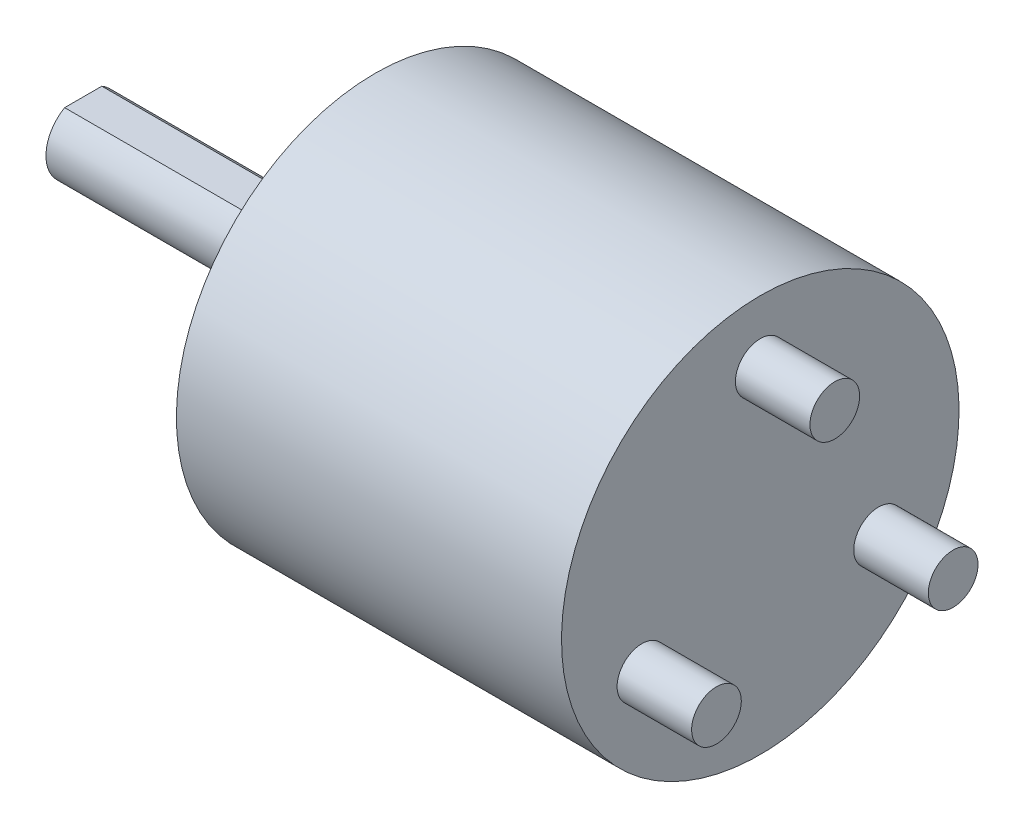
ISO-10303-21;
HEADER;
FILE_DESCRIPTION(('STEP AP214'),'2;1');
FILE_NAME('part.step','',(''),(''),'','','');
FILE_SCHEMA(('AUTOMOTIVE_DESIGN { 1 0 10303 214 1 1 1 1 }'));
ENDSEC;
DATA;
#1=APPLICATION_CONTEXT('core data for automotive mechanical design processes');
#2=APPLICATION_PROTOCOL_DEFINITION('international standard','automotive_design',2000,#1);
#3=PRODUCT_CONTEXT('',#1,'mechanical');
#4=PRODUCT('Part','Part','',(#3));
#5=PRODUCT_RELATED_PRODUCT_CATEGORY('part','',(#4));
#6=PRODUCT_DEFINITION_FORMATION('','',#4);
#7=PRODUCT_DEFINITION_CONTEXT('part definition',#1,'design');
#8=PRODUCT_DEFINITION('design','',#6,#7);
#9=PRODUCT_DEFINITION_SHAPE('','',#8);
#10=(LENGTH_UNIT() NAMED_UNIT(*) SI_UNIT(.MILLI.,.METRE.));
#11=(NAMED_UNIT(*) PLANE_ANGLE_UNIT() SI_UNIT($,.RADIAN.));
#12=(NAMED_UNIT(*) SI_UNIT($,.STERADIAN.) SOLID_ANGLE_UNIT());
#13=UNCERTAINTY_MEASURE_WITH_UNIT(LENGTH_MEASURE(1.E-05),#10,'distance_accuracy_value','');
#14=(GEOMETRIC_REPRESENTATION_CONTEXT(3) GLOBAL_UNCERTAINTY_ASSIGNED_CONTEXT((#13)) GLOBAL_UNIT_ASSIGNED_CONTEXT((#10,
#11,#12)) REPRESENTATION_CONTEXT('',''));
#15=CARTESIAN_POINT('',(0.,0.,0.));
#16=DIRECTION('',(0.,0.,1.));
#17=DIRECTION('',(1.,0.,0.));
#18=AXIS2_PLACEMENT_3D('',#15,#16,#17);
#19=CARTESIAN_POINT('',(16.625,-3.762,-5.775139721));
#20=DIRECTION('',(1.,0.,0.));
#21=DIRECTION('',(0.,1.,0.));
#22=AXIS2_PLACEMENT_3D('',#19,#20,#21);
#23=PLANE('',#22);
#24=CARTESIAN_POINT('',(16.625,-2.75,-4.763139721));
#25=DIRECTION('',(1.,0.,0.));
#26=DIRECTION('',(0.,0.,-1.));
#27=AXIS2_PLACEMENT_3D('',#24,#25,#26);
#28=CIRCLE('',#27,1.);
#29=CARTESIAN_POINT('',(16.625,-2.75,-5.763139721));
#30=VERTEX_POINT('',#29);
#31=EDGE_CURVE('E20',#30,#30,#28,.T.);
#32=ORIENTED_EDGE('',*,*,#31,.T.);
#33=EDGE_LOOP('',(#32));
#34=FACE_BOUND('',#33,.T.);
#35=ADVANCED_FACE('F16',(#34),#23,.T.);
#36=CARTESIAN_POINT('',(16.625,-3.762,5.775139721));
#37=DIRECTION('',(1.,0.,0.));
#38=DIRECTION('',(0.,0.,-1.));
#39=AXIS2_PLACEMENT_3D('',#36,#37,#38);
#40=PLANE('',#39);
#41=CARTESIAN_POINT('',(16.625,-2.75,4.763139721));
#42=DIRECTION('',(1.,0.,0.));
#43=DIRECTION('',(0.,1.,0.));
#44=AXIS2_PLACEMENT_3D('',#41,#42,#43);
#45=CIRCLE('',#44,0.999999999999999);
#46=CARTESIAN_POINT('',(16.625,-1.75,4.763139721));
#47=VERTEX_POINT('',#46);
#48=EDGE_CURVE('E97',#47,#47,#45,.T.);
#49=ORIENTED_EDGE('',*,*,#48,.T.);
#50=EDGE_LOOP('',(#49));
#51=FACE_BOUND('',#50,.T.);
#52=ADVANCED_FACE('F160',(#51),#40,.T.);
#53=CARTESIAN_POINT('',(16.625,4.488,1.012));
#54=DIRECTION('',(1.,0.,0.));
#55=DIRECTION('',(0.,0.,-1.));
#56=AXIS2_PLACEMENT_3D('',#53,#54,#55);
#57=PLANE('',#56);
#58=CARTESIAN_POINT('',(16.625,5.5,0.));
#59=DIRECTION('',(1.,0.,0.));
#60=DIRECTION('',(0.,1.,0.));
#61=AXIS2_PLACEMENT_3D('',#58,#59,#60);
#62=CIRCLE('',#61,1.);
#63=CARTESIAN_POINT('',(16.625,6.5,0.));
#64=VERTEX_POINT('',#63);
#65=EDGE_CURVE('E50',#64,#64,#62,.T.);
#66=ORIENTED_EDGE('',*,*,#65,.T.);
#67=EDGE_LOOP('',(#66));
#68=FACE_BOUND('',#67,.T.);
#69=ADVANCED_FACE('F158',(#68),#57,.T.);
#70=CARTESIAN_POINT('',(-13.625,-1.5168,-1.518));
#71=DIRECTION('',(-1.,0.,0.));
#72=DIRECTION('',(0.,0.,1.));
#73=AXIS2_PLACEMENT_3D('',#70,#71,#72);
#74=PLANE('',#73);
#75=CARTESIAN_POINT('',(-13.625,0.,0.));
#76=DIRECTION('',(1.,0.,0.));
#77=DIRECTION('',(0.,1.,0.));
#78=AXIS2_PLACEMENT_3D('',#75,#76,#77);
#79=CIRCLE('',#78,1.5);
#80=CARTESIAN_POINT('',(-13.625,1.30000000000417,-0.748331477347539));
#81=VERTEX_POINT('',#80);
#82=CARTESIAN_POINT('',(-13.625,1.29999999985069,0.748331477614174));
#83=VERTEX_POINT('',#82);
#84=EDGE_CURVE('E33',#81,#83,#79,.F.);
#85=ORIENTED_EDGE('',*,*,#84,.T.);
#86=DIRECTION('',(0.,0.,-1.));
#87=VECTOR('',#86,1.);
#88=CARTESIAN_POINT('',(-13.625,1.3,0.));
#89=LINE('',#88,#87);
#90=EDGE_CURVE('E48',#83,#81,#89,.T.);
#91=ORIENTED_EDGE('',*,*,#90,.T.);
#92=EDGE_LOOP('',(#85,#91));
#93=FACE_BOUND('',#92,.T.);
#94=ADVANCED_FACE('F47',(#93),#74,.T.);
#95=CARTESIAN_POINT('',(-5.825,1.3,-0.757311455));
#96=DIRECTION('',(-1.,0.,0.));
#97=DIRECTION('',(0.,0.,1.));
#98=AXIS2_PLACEMENT_3D('',#95,#96,#97);
#99=PLANE('',#98);
#100=CARTESIAN_POINT('',(-5.8250000036,0.,0.));
#101=DIRECTION('',(1.,0.,0.));
#102=DIRECTION('',(0.,1.,0.));
#103=AXIS2_PLACEMENT_3D('',#100,#101,#102);
#104=CIRCLE('',#103,1.5);
#105=CARTESIAN_POINT('',(-5.8250000018,1.29999999992534,0.74833147761417));
#106=VERTEX_POINT('',#105);
#107=CARTESIAN_POINT('',(-5.8250000018,1.30000000000209,-0.748331477347535));
#108=VERTEX_POINT('',#107);
#109=EDGE_CURVE('E58',#106,#108,#104,.F.);
#110=ORIENTED_EDGE('',*,*,#109,.T.);
#111=DIRECTION('',(0.,0.,1.));
#112=VECTOR('',#111,1.);
#113=CARTESIAN_POINT('',(-5.825,1.3,0.));
#114=LINE('',#113,#112);
#115=EDGE_CURVE('E42',#108,#106,#114,.T.);
#116=ORIENTED_EDGE('',*,*,#115,.T.);
#117=EDGE_LOOP('',(#110,#116));
#118=FACE_BOUND('',#117,.T.);
#119=ADVANCED_FACE('F118',(#118),#99,.T.);
#120=CARTESIAN_POINT('',(-13.625,1.3,0.748331477));
#121=DIRECTION('',(0.,-1.,0.));
#122=DIRECTION('',(0.,0.,-1.));
#123=AXIS2_PLACEMENT_3D('',#120,#121,#122);
#124=PLANE('',#123);
#125=DIRECTION('',(-1.,0.,0.));
#126=VECTOR('',#125,1.);
#127=CARTESIAN_POINT('',(-9.05,1.29999999970137,0.74833147787356));
#128=LINE('',#127,#126);
#129=EDGE_CURVE('E49',#83,#106,#128,.F.);
#130=ORIENTED_EDGE('',*,*,#129,.T.);
#131=ORIENTED_EDGE('',*,*,#115,.F.);
#132=DIRECTION('',(1.,0.,0.));
#133=VECTOR('',#132,1.);
#134=CARTESIAN_POINT('',(-9.05,1.30000000000835,-0.748331477340291));
#135=LINE('',#134,#133);
#136=EDGE_CURVE('E53',#108,#81,#135,.F.);
#137=ORIENTED_EDGE('',*,*,#136,.T.);
#138=ORIENTED_EDGE('',*,*,#90,.F.);
#139=EDGE_LOOP('',(#130,#131,#137,#138));
#140=FACE_BOUND('',#139,.T.);
#141=ADVANCED_FACE('F52',(#140),#124,.F.);
#142=CARTESIAN_POINT('',(13.625,-2.75,-4.763139721));
#143=DIRECTION('',(1.,0.,0.));
#144=DIRECTION('',(0.,0.,-1.));
#145=AXIS2_PLACEMENT_3D('',#142,#143,#144);
#146=CYLINDRICAL_SURFACE('',#145,1.);
#147=CARTESIAN_POINT('',(13.625,-2.75,-4.763139721));
#148=DIRECTION('',(1.,0.,0.));
#149=DIRECTION('',(0.,0.,-1.));
#150=AXIS2_PLACEMENT_3D('',#147,#148,#149);
#151=CIRCLE('',#150,1.);
#152=CARTESIAN_POINT('',(13.625,-2.75,-5.763139721));
#153=VERTEX_POINT('',#152);
#154=EDGE_CURVE('E63',#153,#153,#151,.F.);
#155=ORIENTED_EDGE('',*,*,#154,.F.);
#156=EDGE_LOOP('',(#155));
#157=FACE_BOUND('',#156,.T.);
#158=ORIENTED_EDGE('',*,*,#31,.F.);
#159=EDGE_LOOP('',(#158));
#160=FACE_BOUND('',#159,.T.);
#161=ADVANCED_FACE('F105',(#157,#160),#146,.T.);
#162=CARTESIAN_POINT('',(13.625,-2.75,4.763139721));
#163=DIRECTION('',(1.,0.,0.));
#164=DIRECTION('',(0.,1.,0.));
#165=AXIS2_PLACEMENT_3D('',#162,#163,#164);
#166=CYLINDRICAL_SURFACE('',#165,0.999999999999999);
#167=CARTESIAN_POINT('',(13.625,-2.75,4.763139721));
#168=DIRECTION('',(1.,0.,0.));
#169=DIRECTION('',(0.,1.,0.));
#170=AXIS2_PLACEMENT_3D('',#167,#168,#169);
#171=CIRCLE('',#170,0.999999999999999);
#172=CARTESIAN_POINT('',(13.625,-1.75,4.763139721));
#173=VERTEX_POINT('',#172);
#174=EDGE_CURVE('E91',#173,#173,#171,.F.);
#175=ORIENTED_EDGE('',*,*,#174,.F.);
#176=EDGE_LOOP('',(#175));
#177=FACE_BOUND('',#176,.T.);
#178=ORIENTED_EDGE('',*,*,#48,.F.);
#179=EDGE_LOOP('',(#178));
#180=FACE_BOUND('',#179,.T.);
#181=ADVANCED_FACE('F107',(#177,#180),#166,.T.);
#182=CARTESIAN_POINT('',(13.625,5.5,0.));
#183=DIRECTION('',(1.,0.,0.));
#184=DIRECTION('',(0.,1.,0.));
#185=AXIS2_PLACEMENT_3D('',#182,#183,#184);
#186=CYLINDRICAL_SURFACE('',#185,1.);
#187=CARTESIAN_POINT('',(13.625,5.5,0.));
#188=DIRECTION('',(1.,0.,0.));
#189=DIRECTION('',(0.,1.,0.));
#190=AXIS2_PLACEMENT_3D('',#187,#188,#189);
#191=CIRCLE('',#190,1.);
#192=CARTESIAN_POINT('',(13.625,6.5,0.));
#193=VERTEX_POINT('',#192);
#194=EDGE_CURVE('E88',#193,#193,#191,.F.);
#195=ORIENTED_EDGE('',*,*,#194,.F.);
#196=EDGE_LOOP('',(#195));
#197=FACE_BOUND('',#196,.T.);
#198=ORIENTED_EDGE('',*,*,#65,.F.);
#199=EDGE_LOOP('',(#198));
#200=FACE_BOUND('',#199,.T.);
#201=ADVANCED_FACE('F115',(#197,#200),#186,.T.);
#202=CARTESIAN_POINT('',(-13.625,0.,0.));
#203=DIRECTION('',(1.,0.,0.));
#204=DIRECTION('',(0.,1.,0.));
#205=AXIS2_PLACEMENT_3D('',#202,#203,#204);
#206=CYLINDRICAL_SURFACE('',#205,1.5);
#207=CARTESIAN_POINT('',(-4.475,0.,0.));
#208=DIRECTION('',(1.,0.,0.));
#209=DIRECTION('',(0.,1.,0.));
#210=AXIS2_PLACEMENT_3D('',#207,#208,#209);
#211=CIRCLE('',#210,1.5);
#212=CARTESIAN_POINT('',(-4.475,1.49999999999999,0.));
#213=VERTEX_POINT('',#212);
#214=EDGE_CURVE('E85',#213,#213,#211,.T.);
#215=ORIENTED_EDGE('',*,*,#214,.F.);
#216=EDGE_LOOP('',(#215));
#217=FACE_BOUND('',#216,.T.);
#218=ORIENTED_EDGE('',*,*,#129,.F.);
#219=ORIENTED_EDGE('',*,*,#84,.F.);
#220=ORIENTED_EDGE('',*,*,#136,.F.);
#221=ORIENTED_EDGE('',*,*,#109,.F.);
#222=EDGE_LOOP('',(#218,#219,#220,#221));
#223=FACE_BOUND('',#222,.T.);
#224=ADVANCED_FACE('F56',(#217,#223),#206,.T.);
#225=CARTESIAN_POINT('',(13.625,-8.096,8.096));
#226=DIRECTION('',(1.,0.,0.));
#227=DIRECTION('',(0.,0.,-1.));
#228=AXIS2_PLACEMENT_3D('',#225,#226,#227);
#229=PLANE('',#228);
#230=ORIENTED_EDGE('',*,*,#194,.T.);
#231=EDGE_LOOP('',(#230));
#232=FACE_BOUND('',#231,.T.);
#233=ORIENTED_EDGE('',*,*,#174,.T.);
#234=EDGE_LOOP('',(#233));
#235=FACE_BOUND('',#234,.T.);
#236=ORIENTED_EDGE('',*,*,#154,.T.);
#237=EDGE_LOOP('',(#236));
#238=FACE_BOUND('',#237,.T.);
#239=CARTESIAN_POINT('',(13.625,0.,0.));
#240=DIRECTION('',(1.,0.,0.));
#241=DIRECTION('',(0.,1.,0.));
#242=AXIS2_PLACEMENT_3D('',#239,#240,#241);
#243=CIRCLE('',#242,8.);
#244=CARTESIAN_POINT('',(13.625,8.,0.));
#245=VERTEX_POINT('',#244);
#246=EDGE_CURVE('E82',#245,#245,#243,.T.);
#247=ORIENTED_EDGE('',*,*,#246,.T.);
#248=EDGE_LOOP('',(#247));
#249=FACE_BOUND('',#248,.T.);
#250=ADVANCED_FACE('F148',(#232,#235,#238,#249),#229,.T.);
#251=CARTESIAN_POINT('',(1.125,4.207098,0.792902));
#252=DIRECTION('',(1.,0.,0.));
#253=DIRECTION('',(0.,0.,-1.));
#254=AXIS2_PLACEMENT_3D('',#251,#252,#253);
#255=PLANE('',#254);
#256=CARTESIAN_POINT('',(1.125,5.,0.));
#257=DIRECTION('',(-1.,0.,0.));
#258=DIRECTION('',(0.,0.,1.));
#259=AXIS2_PLACEMENT_3D('',#256,#257,#258);
#260=CIRCLE('',#259,0.7835);
#261=CARTESIAN_POINT('',(1.125,5.,0.7835));
#262=VERTEX_POINT('',#261);
#263=EDGE_CURVE('E79',#262,#262,#260,.F.);
#264=ORIENTED_EDGE('',*,*,#263,.F.);
#265=EDGE_LOOP('',(#264));
#266=FACE_BOUND('',#265,.T.);
#267=ADVANCED_FACE('F174',(#266),#255,.F.);
#268=CARTESIAN_POINT('',(-4.475,-3.036,-3.036));
#269=DIRECTION('',(-1.,0.,0.));
#270=DIRECTION('',(0.,0.,1.));
#271=AXIS2_PLACEMENT_3D('',#268,#269,#270);
#272=PLANE('',#271);
#273=ORIENTED_EDGE('',*,*,#214,.T.);
#274=EDGE_LOOP('',(#273));
#275=FACE_BOUND('',#274,.T.);
#276=CARTESIAN_POINT('',(-4.475,0.,0.));
#277=DIRECTION('',(1.,0.,0.));
#278=DIRECTION('',(0.,1.,0.));
#279=AXIS2_PLACEMENT_3D('',#276,#277,#278);
#280=CIRCLE('',#279,3.);
#281=CARTESIAN_POINT('',(-4.475,3.,0.));
#282=VERTEX_POINT('',#281);
#283=EDGE_CURVE('E76',#282,#282,#280,.F.);
#284=ORIENTED_EDGE('',*,*,#283,.T.);
#285=EDGE_LOOP('',(#284));
#286=FACE_BOUND('',#285,.T.);
#287=ADVANCED_FACE('F144',(#275,#286),#272,.T.);
#288=CARTESIAN_POINT('',(-1.875,0.,0.));
#289=DIRECTION('',(1.,0.,0.));
#290=DIRECTION('',(0.,1.,0.));
#291=AXIS2_PLACEMENT_3D('',#288,#289,#290);
#292=CYLINDRICAL_SURFACE('',#291,8.);
#293=CARTESIAN_POINT('',(-1.875,0.,0.));
#294=DIRECTION('',(1.,0.,0.));
#295=DIRECTION('',(0.,1.,0.));
#296=AXIS2_PLACEMENT_3D('',#293,#294,#295);
#297=CIRCLE('',#296,8.);
#298=CARTESIAN_POINT('',(-1.875,8.,0.));
#299=VERTEX_POINT('',#298);
#300=EDGE_CURVE('E73',#299,#299,#297,.F.);
#301=ORIENTED_EDGE('',*,*,#300,.F.);
#302=EDGE_LOOP('',(#301));
#303=FACE_BOUND('',#302,.T.);
#304=ORIENTED_EDGE('',*,*,#246,.F.);
#305=EDGE_LOOP('',(#304));
#306=FACE_BOUND('',#305,.T.);
#307=ADVANCED_FACE('F140',(#303,#306),#292,.T.);
#308=CARTESIAN_POINT('',(1.125,5.,0.));
#309=DIRECTION('',(-1.,0.,0.));
#310=DIRECTION('',(0.,0.,1.));
#311=AXIS2_PLACEMENT_3D('',#308,#309,#310);
#312=CYLINDRICAL_SURFACE('',#311,0.7835);
#313=CARTESIAN_POINT('',(-1.875,5.,0.));
#314=DIRECTION('',(-1.,0.,0.));
#315=DIRECTION('',(0.,0.,1.));
#316=AXIS2_PLACEMENT_3D('',#313,#314,#315);
#317=CIRCLE('',#316,0.7835);
#318=CARTESIAN_POINT('',(-1.875,5.,0.7835));
#319=VERTEX_POINT('',#318);
#320=EDGE_CURVE('E70',#319,#319,#317,.F.);
#321=ORIENTED_EDGE('',*,*,#320,.F.);
#322=EDGE_LOOP('',(#321));
#323=FACE_BOUND('',#322,.T.);
#324=ORIENTED_EDGE('',*,*,#263,.T.);
#325=EDGE_LOOP('',(#324));
#326=FACE_BOUND('',#325,.T.);
#327=ADVANCED_FACE('F136',(#323,#326),#312,.F.);
#328=CARTESIAN_POINT('',(-4.475,0.,0.));
#329=DIRECTION('',(1.,0.,0.));
#330=DIRECTION('',(0.,1.,0.));
#331=AXIS2_PLACEMENT_3D('',#328,#329,#330);
#332=CYLINDRICAL_SURFACE('',#331,3.);
#333=CARTESIAN_POINT('',(-1.875,0.,0.));
#334=DIRECTION('',(1.,0.,0.));
#335=DIRECTION('',(0.,1.,0.));
#336=AXIS2_PLACEMENT_3D('',#333,#334,#335);
#337=CIRCLE('',#336,3.);
#338=CARTESIAN_POINT('',(-1.875,3.,0.));
#339=VERTEX_POINT('',#338);
#340=EDGE_CURVE('E67',#339,#339,#337,.T.);
#341=ORIENTED_EDGE('',*,*,#340,.F.);
#342=EDGE_LOOP('',(#341));
#343=FACE_BOUND('',#342,.T.);
#344=ORIENTED_EDGE('',*,*,#283,.F.);
#345=EDGE_LOOP('',(#344));
#346=FACE_BOUND('',#345,.T.);
#347=ADVANCED_FACE('F133',(#343,#346),#332,.T.);
#348=CARTESIAN_POINT('',(1.125,-5.792902,0.792902));
#349=DIRECTION('',(1.,0.,0.));
#350=DIRECTION('',(0.,0.,-1.));
#351=AXIS2_PLACEMENT_3D('',#348,#349,#350);
#352=PLANE('',#351);
#353=CARTESIAN_POINT('',(1.125,-5.,0.));
#354=DIRECTION('',(-1.,0.,0.));
#355=DIRECTION('',(0.,0.,1.));
#356=AXIS2_PLACEMENT_3D('',#353,#354,#355);
#357=CIRCLE('',#356,0.7835);
#358=CARTESIAN_POINT('',(1.125,-5.,0.7835));
#359=VERTEX_POINT('',#358);
#360=EDGE_CURVE('E25',#359,#359,#357,.F.);
#361=ORIENTED_EDGE('',*,*,#360,.F.);
#362=EDGE_LOOP('',(#361));
#363=FACE_BOUND('',#362,.T.);
#364=ADVANCED_FACE('F129',(#363),#352,.F.);
#365=CARTESIAN_POINT('',(-1.875,-8.096,-8.096));
#366=DIRECTION('',(-1.,0.,0.));
#367=DIRECTION('',(0.,0.,1.));
#368=AXIS2_PLACEMENT_3D('',#365,#366,#367);
#369=PLANE('',#368);
#370=ORIENTED_EDGE('',*,*,#340,.T.);
#371=EDGE_LOOP('',(#370));
#372=FACE_BOUND('',#371,.T.);
#373=ORIENTED_EDGE('',*,*,#320,.T.);
#374=EDGE_LOOP('',(#373));
#375=FACE_BOUND('',#374,.T.);
#376=CARTESIAN_POINT('',(-1.875,-5.,0.));
#377=DIRECTION('',(-1.,0.,0.));
#378=DIRECTION('',(0.,0.,1.));
#379=AXIS2_PLACEMENT_3D('',#376,#377,#378);
#380=CIRCLE('',#379,0.7835);
#381=CARTESIAN_POINT('',(-1.875,-5.,0.7835));
#382=VERTEX_POINT('',#381);
#383=EDGE_CURVE('E11',#382,#382,#380,.T.);
#384=ORIENTED_EDGE('',*,*,#383,.F.);
#385=EDGE_LOOP('',(#384));
#386=FACE_BOUND('',#385,.T.);
#387=ORIENTED_EDGE('',*,*,#300,.T.);
#388=EDGE_LOOP('',(#387));
#389=FACE_BOUND('',#388,.T.);
#390=ADVANCED_FACE('F18',(#372,#375,#386,#389),#369,.T.);
#391=CARTESIAN_POINT('',(1.125,-5.,0.));
#392=DIRECTION('',(-1.,0.,0.));
#393=DIRECTION('',(0.,0.,1.));
#394=AXIS2_PLACEMENT_3D('',#391,#392,#393);
#395=CYLINDRICAL_SURFACE('',#394,0.7835);
#396=ORIENTED_EDGE('',*,*,#383,.T.);
#397=EDGE_LOOP('',(#396));
#398=FACE_BOUND('',#397,.T.);
#399=ORIENTED_EDGE('',*,*,#360,.T.);
#400=EDGE_LOOP('',(#399));
#401=FACE_BOUND('',#400,.T.);
#402=ADVANCED_FACE('F122',(#398,#401),#395,.F.);
#403=CLOSED_SHELL('',(#35,#52,#69,#94,#119,#141,#161,#181,#201,#224,#250,#267,#287,#307,#327,
#347,#364,#390,#402));
#404=MANIFOLD_SOLID_BREP('B1',#403);
#405=ADVANCED_BREP_SHAPE_REPRESENTATION('',(#18,#404),#14);
#406=SHAPE_DEFINITION_REPRESENTATION(#9,#405);
ENDSEC;
END-ISO-10303-21;
